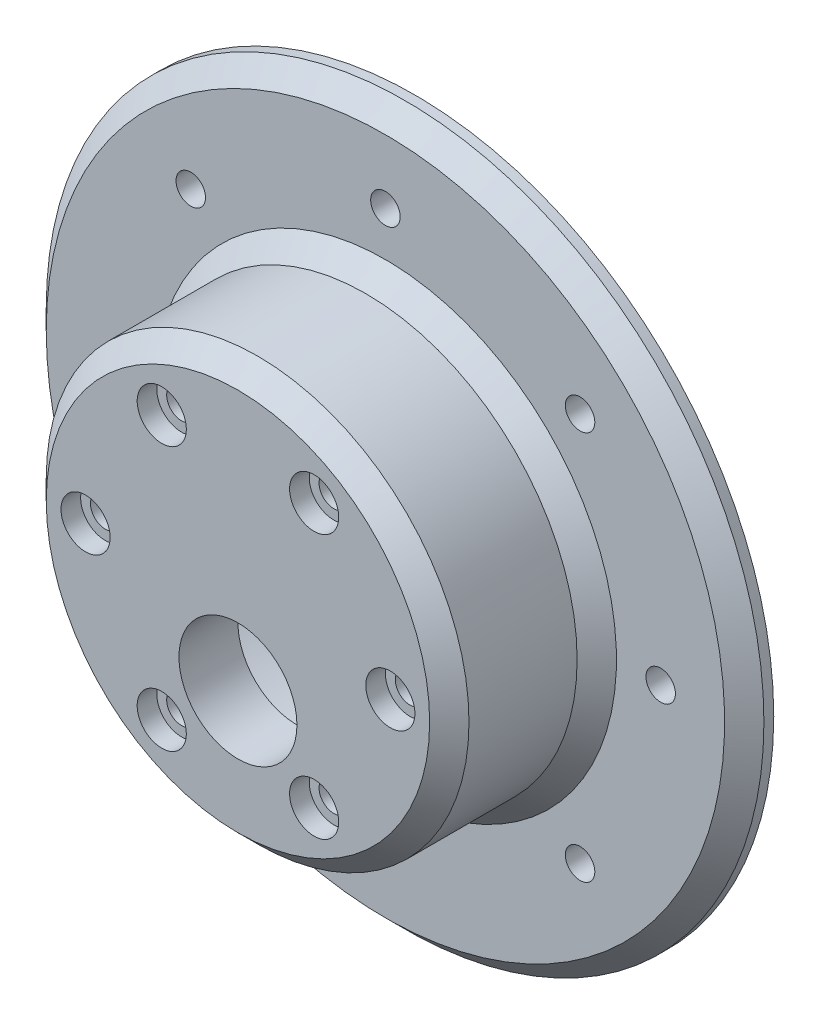
ISO-10303-21;
HEADER;
FILE_DESCRIPTION(('STEP AP214'),'2;1');
FILE_NAME('part.step','',(''),(''),'','','');
FILE_SCHEMA(('AUTOMOTIVE_DESIGN { 1 0 10303 214 1 1 1 1 }'));
ENDSEC;
DATA;
#1=APPLICATION_CONTEXT('core data for automotive mechanical design processes');
#2=APPLICATION_PROTOCOL_DEFINITION('international standard','automotive_design',2000,#1);
#3=PRODUCT_CONTEXT('',#1,'mechanical');
#4=PRODUCT('Part','Part','',(#3));
#5=PRODUCT_RELATED_PRODUCT_CATEGORY('part','',(#4));
#6=PRODUCT_DEFINITION_FORMATION('','',#4);
#7=PRODUCT_DEFINITION_CONTEXT('part definition',#1,'design');
#8=PRODUCT_DEFINITION('design','',#6,#7);
#9=PRODUCT_DEFINITION_SHAPE('','',#8);
#10=(LENGTH_UNIT() NAMED_UNIT(*) SI_UNIT(.MILLI.,.METRE.));
#11=(NAMED_UNIT(*) PLANE_ANGLE_UNIT() SI_UNIT($,.RADIAN.));
#12=(NAMED_UNIT(*) SI_UNIT($,.STERADIAN.) SOLID_ANGLE_UNIT());
#13=UNCERTAINTY_MEASURE_WITH_UNIT(LENGTH_MEASURE(1.E-05),#10,'distance_accuracy_value','');
#14=(GEOMETRIC_REPRESENTATION_CONTEXT(3) GLOBAL_UNCERTAINTY_ASSIGNED_CONTEXT((#13)) GLOBAL_UNIT_ASSIGNED_CONTEXT((#10,
#11,#12)) REPRESENTATION_CONTEXT('',''));
#15=CARTESIAN_POINT('',(0.,0.,0.));
#16=DIRECTION('',(0.,0.,1.));
#17=DIRECTION('',(1.,0.,0.));
#18=AXIS2_PLACEMENT_3D('',#15,#16,#17);
#19=CARTESIAN_POINT('',(0.,36.5,-9.));
#20=DIRECTION('',(0.,0.,-1.));
#21=DIRECTION('',(-1.,0.,0.));
#22=AXIS2_PLACEMENT_3D('',#19,#20,#21);
#23=PLANE('',#22);
#24=CARTESIAN_POINT('',(19.7989898732231,19.7989898732236,-9.));
#25=DIRECTION('',(0.,0.,1.));
#26=DIRECTION('',(1.,0.,0.));
#27=AXIS2_PLACEMENT_3D('',#24,#25,#26);
#28=CIRCLE('',#27,1.49999999999999);
#29=CARTESIAN_POINT('',(21.2989898732231,19.7989898732236,-9.));
#30=VERTEX_POINT('',#29);
#31=EDGE_CURVE('E63',#30,#30,#28,.T.);
#32=ORIENTED_EDGE('',*,*,#31,.F.);
#33=EDGE_LOOP('',(#32));
#34=FACE_BOUND('',#33,.T.);
#35=CARTESIAN_POINT('',(28.,2.93284432462823E-13,-9.));
#36=DIRECTION('',(0.,0.,1.));
#37=DIRECTION('',(1.,0.,0.));
#38=AXIS2_PLACEMENT_3D('',#35,#36,#37);
#39=CIRCLE('',#38,1.49999999999999);
#40=CARTESIAN_POINT('',(29.5,2.93284432462823E-13,-9.));
#41=VERTEX_POINT('',#40);
#42=EDGE_CURVE('E52',#41,#41,#39,.T.);
#43=ORIENTED_EDGE('',*,*,#42,.F.);
#44=EDGE_LOOP('',(#43));
#45=FACE_BOUND('',#44,.T.);
#46=CARTESIAN_POINT('',(0.,0.,-9.));
#47=DIRECTION('',(0.,0.,-1.));
#48=DIRECTION('',(-1.,0.,0.));
#49=AXIS2_PLACEMENT_3D('',#46,#47,#48);
#50=CIRCLE('',#49,34.5);
#51=CARTESIAN_POINT('',(-34.5,0.,-9.));
#52=VERTEX_POINT('',#51);
#53=EDGE_CURVE('E203',#52,#52,#50,.F.);
#54=ORIENTED_EDGE('',*,*,#53,.T.);
#55=EDGE_LOOP('',(#54));
#56=FACE_BOUND('',#55,.T.);
#57=CARTESIAN_POINT('',(0.,0.,-9.));
#58=DIRECTION('',(0.,0.,-1.));
#59=DIRECTION('',(-1.,0.,0.));
#60=AXIS2_PLACEMENT_3D('',#57,#58,#59);
#61=CIRCLE('',#60,23.5);
#62=CARTESIAN_POINT('',(-23.5,0.,-9.));
#63=VERTEX_POINT('',#62);
#64=EDGE_CURVE('E46',#63,#63,#61,.T.);
#65=ORIENTED_EDGE('',*,*,#64,.T.);
#66=EDGE_LOOP('',(#65));
#67=FACE_BOUND('',#66,.T.);
#68=CARTESIAN_POINT('',(0.,28.,-9.));
#69=DIRECTION('',(0.,0.,1.));
#70=DIRECTION('',(1.,0.,0.));
#71=AXIS2_PLACEMENT_3D('',#68,#69,#70);
#72=CIRCLE('',#71,1.49999999999999);
#73=CARTESIAN_POINT('',(1.49999999999999,28.,-9.));
#74=VERTEX_POINT('',#73);
#75=EDGE_CURVE('E92',#74,#74,#72,.T.);
#76=ORIENTED_EDGE('',*,*,#75,.F.);
#77=EDGE_LOOP('',(#76));
#78=FACE_BOUND('',#77,.T.);
#79=CARTESIAN_POINT('',(-19.7989898732234,19.7989898732233,-9.));
#80=DIRECTION('',(0.,0.,1.));
#81=DIRECTION('',(1.,0.,0.));
#82=AXIS2_PLACEMENT_3D('',#79,#80,#81);
#83=CIRCLE('',#82,1.49999999999999);
#84=CARTESIAN_POINT('',(-18.2989898732234,19.7989898732233,-9.));
#85=VERTEX_POINT('',#84);
#86=EDGE_CURVE('E86',#85,#85,#83,.T.);
#87=ORIENTED_EDGE('',*,*,#86,.F.);
#88=EDGE_LOOP('',(#87));
#89=FACE_BOUND('',#88,.T.);
#90=CARTESIAN_POINT('',(-28.,0.,-9.));
#91=DIRECTION('',(0.,0.,1.));
#92=DIRECTION('',(1.,0.,0.));
#93=AXIS2_PLACEMENT_3D('',#90,#91,#92);
#94=CIRCLE('',#93,1.49999999999999);
#95=CARTESIAN_POINT('',(-26.5,0.,-9.));
#96=VERTEX_POINT('',#95);
#97=EDGE_CURVE('E80',#96,#96,#94,.T.);
#98=ORIENTED_EDGE('',*,*,#97,.F.);
#99=EDGE_LOOP('',(#98));
#100=FACE_BOUND('',#99,.T.);
#101=CARTESIAN_POINT('',(-19.7989898732232,-19.7989898732234,-9.));
#102=DIRECTION('',(0.,0.,1.));
#103=DIRECTION('',(1.,0.,0.));
#104=AXIS2_PLACEMENT_3D('',#101,#102,#103);
#105=CIRCLE('',#104,1.49999999999999);
#106=CARTESIAN_POINT('',(-18.2989898732232,-19.7989898732234,-9.));
#107=VERTEX_POINT('',#106);
#108=EDGE_CURVE('E74',#107,#107,#105,.T.);
#109=ORIENTED_EDGE('',*,*,#108,.F.);
#110=EDGE_LOOP('',(#109));
#111=FACE_BOUND('',#110,.T.);
#112=CARTESIAN_POINT('',(0.,-28.,-9.));
#113=DIRECTION('',(0.,0.,1.));
#114=DIRECTION('',(1.,0.,0.));
#115=AXIS2_PLACEMENT_3D('',#112,#113,#114);
#116=CIRCLE('',#115,1.49999999999999);
#117=CARTESIAN_POINT('',(1.49999999999999,-28.,-9.));
#118=VERTEX_POINT('',#117);
#119=EDGE_CURVE('E68',#118,#118,#116,.T.);
#120=ORIENTED_EDGE('',*,*,#119,.F.);
#121=EDGE_LOOP('',(#120));
#122=FACE_BOUND('',#121,.T.);
#123=CARTESIAN_POINT('',(19.7989898732235,-19.7989898732232,-9.));
#124=DIRECTION('',(0.,0.,1.));
#125=DIRECTION('',(1.,0.,0.));
#126=AXIS2_PLACEMENT_3D('',#123,#124,#125);
#127=CIRCLE('',#126,1.49999999999999);
#128=CARTESIAN_POINT('',(21.2989898732235,-19.7989898732232,-9.));
#129=VERTEX_POINT('',#128);
#130=EDGE_CURVE('E51',#129,#129,#127,.T.);
#131=ORIENTED_EDGE('',*,*,#130,.F.);
#132=EDGE_LOOP('',(#131));
#133=FACE_BOUND('',#132,.T.);
#134=ADVANCED_FACE('F33',(#34,#45,#56,#67,#78,#89,#100,#111,#122,#133),#23,.F.);
#135=CARTESIAN_POINT('',(0.,0.,0.));
#136=DIRECTION('',(0.,0.,1.));
#137=DIRECTION('',(1.,0.,0.));
#138=AXIS2_PLACEMENT_3D('',#135,#136,#137);
#139=PLANE('',#138);
#140=CARTESIAN_POINT('',(0.,-7.,0.));
#141=DIRECTION('',(0.,0.,1.));
#142=DIRECTION('',(1.,0.,0.));
#143=AXIS2_PLACEMENT_3D('',#140,#141,#142);
#144=CIRCLE('',#143,6.);
#145=CARTESIAN_POINT('',(6.,-7.,0.));
#146=VERTEX_POINT('',#145);
#147=EDGE_CURVE('E101',#146,#146,#144,.T.);
#148=ORIENTED_EDGE('',*,*,#147,.T.);
#149=EDGE_LOOP('',(#148));
#150=FACE_BOUND('',#149,.T.);
#151=CARTESIAN_POINT('',(7.75000000000016,-13.4233937586587,0.));
#152=DIRECTION('',(0.,0.,1.));
#153=DIRECTION('',(1.,0.,0.));
#154=AXIS2_PLACEMENT_3D('',#151,#152,#153);
#155=CIRCLE('',#154,1.5);
#156=CARTESIAN_POINT('',(9.25000000000016,-13.4233937586587,0.));
#157=VERTEX_POINT('',#156);
#158=EDGE_CURVE('E113',#157,#157,#155,.T.);
#159=ORIENTED_EDGE('',*,*,#158,.T.);
#160=EDGE_LOOP('',(#159));
#161=FACE_BOUND('',#160,.T.);
#162=CARTESIAN_POINT('',(-7.74999999999987,-13.4233937586589,0.));
#163=DIRECTION('',(0.,0.,1.));
#164=DIRECTION('',(1.,0.,0.));
#165=AXIS2_PLACEMENT_3D('',#162,#163,#164);
#166=CIRCLE('',#165,1.5);
#167=CARTESIAN_POINT('',(-6.24999999999988,-13.4233937586589,0.));
#168=VERTEX_POINT('',#167);
#169=EDGE_CURVE('E123',#168,#168,#166,.T.);
#170=ORIENTED_EDGE('',*,*,#169,.T.);
#171=EDGE_LOOP('',(#170));
#172=FACE_BOUND('',#171,.T.);
#173=CARTESIAN_POINT('',(-15.5,0.,0.));
#174=DIRECTION('',(0.,0.,1.));
#175=DIRECTION('',(1.,0.,0.));
#176=AXIS2_PLACEMENT_3D('',#173,#174,#175);
#177=CIRCLE('',#176,1.5);
#178=CARTESIAN_POINT('',(-14.,0.,0.));
#179=VERTEX_POINT('',#178);
#180=EDGE_CURVE('E133',#179,#179,#177,.T.);
#181=ORIENTED_EDGE('',*,*,#180,.T.);
#182=EDGE_LOOP('',(#181));
#183=FACE_BOUND('',#182,.T.);
#184=CARTESIAN_POINT('',(-7.75000000000006,13.4233937586588,0.));
#185=DIRECTION('',(0.,0.,1.));
#186=DIRECTION('',(1.,0.,0.));
#187=AXIS2_PLACEMENT_3D('',#184,#185,#186);
#188=CIRCLE('',#187,1.5);
#189=CARTESIAN_POINT('',(-6.25000000000006,13.4233937586588,0.));
#190=VERTEX_POINT('',#189);
#191=EDGE_CURVE('E143',#190,#190,#188,.T.);
#192=ORIENTED_EDGE('',*,*,#191,.T.);
#193=EDGE_LOOP('',(#192));
#194=FACE_BOUND('',#193,.T.);
#195=CARTESIAN_POINT('',(7.74999999999997,13.4233937586588,0.));
#196=DIRECTION('',(0.,0.,1.));
#197=DIRECTION('',(1.,0.,0.));
#198=AXIS2_PLACEMENT_3D('',#195,#196,#197);
#199=CIRCLE('',#198,1.5);
#200=CARTESIAN_POINT('',(9.24999999999997,13.4233937586588,0.));
#201=VERTEX_POINT('',#200);
#202=EDGE_CURVE('E153',#201,#201,#199,.T.);
#203=ORIENTED_EDGE('',*,*,#202,.T.);
#204=EDGE_LOOP('',(#203));
#205=FACE_BOUND('',#204,.T.);
#206=CARTESIAN_POINT('',(15.5,0.,0.));
#207=DIRECTION('',(0.,0.,1.));
#208=DIRECTION('',(1.,0.,0.));
#209=AXIS2_PLACEMENT_3D('',#206,#207,#208);
#210=CIRCLE('',#209,1.5);
#211=CARTESIAN_POINT('',(17.,0.,0.));
#212=VERTEX_POINT('',#211);
#213=EDGE_CURVE('E163',#212,#212,#210,.T.);
#214=ORIENTED_EDGE('',*,*,#213,.T.);
#215=EDGE_LOOP('',(#214));
#216=FACE_BOUND('',#215,.T.);
#217=CARTESIAN_POINT('',(0.,0.,0.));
#218=DIRECTION('',(0.,0.,1.));
#219=DIRECTION('',(1.,0.,0.));
#220=AXIS2_PLACEMENT_3D('',#217,#218,#219);
#221=CIRCLE('',#220,18.5);
#222=CARTESIAN_POINT('',(18.5,0.,0.));
#223=VERTEX_POINT('',#222);
#224=EDGE_CURVE('E182',#223,#223,#221,.T.);
#225=ORIENTED_EDGE('',*,*,#224,.F.);
#226=EDGE_LOOP('',(#225));
#227=FACE_BOUND('',#226,.T.);
#228=ADVANCED_FACE('F238',(#150,#161,#172,#183,#194,#205,#216,#227),#139,.F.);
#229=CARTESIAN_POINT('',(0.,0.,6.));
#230=DIRECTION('',(0.,0.,1.));
#231=DIRECTION('',(1.,0.,0.));
#232=AXIS2_PLACEMENT_3D('',#229,#230,#231);
#233=CYLINDRICAL_SURFACE('',#232,18.5);
#234=CARTESIAN_POINT('',(0.,0.,-12.));
#235=DIRECTION('',(0.,0.,1.));
#236=DIRECTION('',(1.,0.,0.));
#237=AXIS2_PLACEMENT_3D('',#234,#235,#236);
#238=CIRCLE('',#237,18.5);
#239=CARTESIAN_POINT('',(18.5,0.,-12.));
#240=VERTEX_POINT('',#239);
#241=EDGE_CURVE('E179',#240,#240,#238,.T.);
#242=ORIENTED_EDGE('',*,*,#241,.F.);
#243=EDGE_LOOP('',(#242));
#244=FACE_BOUND('',#243,.T.);
#245=ORIENTED_EDGE('',*,*,#224,.T.);
#246=EDGE_LOOP('',(#245));
#247=FACE_BOUND('',#246,.T.);
#248=ADVANCED_FACE('F244',(#244,#247),#233,.F.);
#249=CARTESIAN_POINT('',(0.,18.5,-12.));
#250=DIRECTION('',(0.,0.,1.));
#251=DIRECTION('',(1.,0.,0.));
#252=AXIS2_PLACEMENT_3D('',#249,#250,#251);
#253=PLANE('',#252);
#254=CARTESIAN_POINT('',(0.,0.,-12.));
#255=DIRECTION('',(0.,0.,1.));
#256=DIRECTION('',(1.,0.,0.));
#257=AXIS2_PLACEMENT_3D('',#254,#255,#256);
#258=CIRCLE('',#257,23.5);
#259=CARTESIAN_POINT('',(23.5,0.,-12.));
#260=VERTEX_POINT('',#259);
#261=EDGE_CURVE('E176',#260,#260,#258,.T.);
#262=ORIENTED_EDGE('',*,*,#261,.F.);
#263=EDGE_LOOP('',(#262));
#264=FACE_BOUND('',#263,.T.);
#265=ORIENTED_EDGE('',*,*,#241,.T.);
#266=EDGE_LOOP('',(#265));
#267=FACE_BOUND('',#266,.T.);
#268=ADVANCED_FACE('F269',(#264,#267),#253,.F.);
#269=CARTESIAN_POINT('',(0.,0.,6.));
#270=DIRECTION('',(0.,0.,1.));
#271=DIRECTION('',(1.,0.,0.));
#272=AXIS2_PLACEMENT_3D('',#269,#270,#271);
#273=CYLINDRICAL_SURFACE('',#272,23.5);
#274=CARTESIAN_POINT('',(0.,0.,-11.));
#275=DIRECTION('',(0.,0.,1.));
#276=DIRECTION('',(1.,0.,0.));
#277=AXIS2_PLACEMENT_3D('',#274,#275,#276);
#278=CIRCLE('',#277,23.5);
#279=CARTESIAN_POINT('',(23.5,0.,-11.));
#280=VERTEX_POINT('',#279);
#281=EDGE_CURVE('E173',#280,#280,#278,.T.);
#282=ORIENTED_EDGE('',*,*,#281,.F.);
#283=EDGE_LOOP('',(#282));
#284=FACE_BOUND('',#283,.T.);
#285=ORIENTED_EDGE('',*,*,#261,.T.);
#286=EDGE_LOOP('',(#285));
#287=FACE_BOUND('',#286,.T.);
#288=ADVANCED_FACE('F265',(#284,#287),#273,.T.);
#289=CARTESIAN_POINT('',(0.,23.5,-11.));
#290=DIRECTION('',(0.,0.,1.));
#291=DIRECTION('',(1.,0.,0.));
#292=AXIS2_PLACEMENT_3D('',#289,#290,#291);
#293=PLANE('',#292);
#294=CARTESIAN_POINT('',(0.,0.,-11.));
#295=DIRECTION('',(0.,0.,1.));
#296=DIRECTION('',(1.,0.,0.));
#297=AXIS2_PLACEMENT_3D('',#294,#295,#296);
#298=CIRCLE('',#297,25.5);
#299=CARTESIAN_POINT('',(25.5,0.,-11.));
#300=VERTEX_POINT('',#299);
#301=EDGE_CURVE('E170',#300,#300,#298,.T.);
#302=ORIENTED_EDGE('',*,*,#301,.F.);
#303=EDGE_LOOP('',(#302));
#304=FACE_BOUND('',#303,.T.);
#305=ORIENTED_EDGE('',*,*,#281,.T.);
#306=EDGE_LOOP('',(#305));
#307=FACE_BOUND('',#306,.T.);
#308=ADVANCED_FACE('F261',(#304,#307),#293,.F.);
#309=CARTESIAN_POINT('',(0.,0.,6.));
#310=DIRECTION('',(0.,0.,1.));
#311=DIRECTION('',(1.,0.,0.));
#312=AXIS2_PLACEMENT_3D('',#309,#310,#311);
#313=CYLINDRICAL_SURFACE('',#312,25.5);
#314=CARTESIAN_POINT('',(0.,0.,-12.));
#315=DIRECTION('',(0.,0.,1.));
#316=DIRECTION('',(1.,0.,0.));
#317=AXIS2_PLACEMENT_3D('',#314,#315,#316);
#318=CIRCLE('',#317,25.5);
#319=CARTESIAN_POINT('',(25.5,0.,-12.));
#320=VERTEX_POINT('',#319);
#321=EDGE_CURVE('E167',#320,#320,#318,.T.);
#322=ORIENTED_EDGE('',*,*,#321,.F.);
#323=EDGE_LOOP('',(#322));
#324=FACE_BOUND('',#323,.T.);
#325=ORIENTED_EDGE('',*,*,#301,.T.);
#326=EDGE_LOOP('',(#325));
#327=FACE_BOUND('',#326,.T.);
#328=ADVANCED_FACE('F257',(#324,#327),#313,.F.);
#329=CARTESIAN_POINT('',(0.,25.5,-12.));
#330=DIRECTION('',(0.,0.,1.));
#331=DIRECTION('',(1.,0.,0.));
#332=AXIS2_PLACEMENT_3D('',#329,#330,#331);
#333=PLANE('',#332);
#334=CARTESIAN_POINT('',(19.7989898732231,19.7989898732236,-12.));
#335=DIRECTION('',(0.,0.,1.));
#336=DIRECTION('',(1.,0.,0.));
#337=AXIS2_PLACEMENT_3D('',#334,#335,#336);
#338=CIRCLE('',#337,1.49999999999999);
#339=CARTESIAN_POINT('',(21.2989898732231,19.7989898732236,-12.));
#340=VERTEX_POINT('',#339);
#341=EDGE_CURVE('E37',#340,#340,#338,.T.);
#342=ORIENTED_EDGE('',*,*,#341,.T.);
#343=EDGE_LOOP('',(#342));
#344=FACE_BOUND('',#343,.T.);
#345=CARTESIAN_POINT('',(28.,2.93284432462823E-13,-12.));
#346=DIRECTION('',(0.,0.,1.));
#347=DIRECTION('',(1.,0.,0.));
#348=AXIS2_PLACEMENT_3D('',#345,#346,#347);
#349=CIRCLE('',#348,1.49999999999999);
#350=CARTESIAN_POINT('',(29.5,2.93284432462823E-13,-12.));
#351=VERTEX_POINT('',#350);
#352=EDGE_CURVE('E49',#351,#351,#349,.T.);
#353=ORIENTED_EDGE('',*,*,#352,.T.);
#354=EDGE_LOOP('',(#353));
#355=FACE_BOUND('',#354,.T.);
#356=CARTESIAN_POINT('',(19.7989898732235,-19.7989898732232,-12.));
#357=DIRECTION('',(0.,0.,1.));
#358=DIRECTION('',(1.,0.,0.));
#359=AXIS2_PLACEMENT_3D('',#356,#357,#358);
#360=CIRCLE('',#359,1.49999999999999);
#361=CARTESIAN_POINT('',(21.2989898732235,-19.7989898732232,-12.));
#362=VERTEX_POINT('',#361);
#363=EDGE_CURVE('E56',#362,#362,#360,.T.);
#364=ORIENTED_EDGE('',*,*,#363,.T.);
#365=EDGE_LOOP('',(#364));
#366=FACE_BOUND('',#365,.T.);
#367=CARTESIAN_POINT('',(0.,-28.,-12.));
#368=DIRECTION('',(0.,0.,1.));
#369=DIRECTION('',(1.,0.,0.));
#370=AXIS2_PLACEMENT_3D('',#367,#368,#369);
#371=CIRCLE('',#370,1.49999999999999);
#372=CARTESIAN_POINT('',(1.49999999999999,-28.,-12.));
#373=VERTEX_POINT('',#372);
#374=EDGE_CURVE('E71',#373,#373,#371,.T.);
#375=ORIENTED_EDGE('',*,*,#374,.T.);
#376=EDGE_LOOP('',(#375));
#377=FACE_BOUND('',#376,.T.);
#378=CARTESIAN_POINT('',(-19.7989898732232,-19.7989898732234,-12.));
#379=DIRECTION('',(0.,0.,1.));
#380=DIRECTION('',(1.,0.,0.));
#381=AXIS2_PLACEMENT_3D('',#378,#379,#380);
#382=CIRCLE('',#381,1.49999999999999);
#383=CARTESIAN_POINT('',(-18.2989898732232,-19.7989898732234,-12.));
#384=VERTEX_POINT('',#383);
#385=EDGE_CURVE('E77',#384,#384,#382,.T.);
#386=ORIENTED_EDGE('',*,*,#385,.T.);
#387=EDGE_LOOP('',(#386));
#388=FACE_BOUND('',#387,.T.);
#389=CARTESIAN_POINT('',(-28.,0.,-12.));
#390=DIRECTION('',(0.,0.,1.));
#391=DIRECTION('',(1.,0.,0.));
#392=AXIS2_PLACEMENT_3D('',#389,#390,#391);
#393=CIRCLE('',#392,1.49999999999999);
#394=CARTESIAN_POINT('',(-26.5,0.,-12.));
#395=VERTEX_POINT('',#394);
#396=EDGE_CURVE('E83',#395,#395,#393,.T.);
#397=ORIENTED_EDGE('',*,*,#396,.T.);
#398=EDGE_LOOP('',(#397));
#399=FACE_BOUND('',#398,.T.);
#400=CARTESIAN_POINT('',(-19.7989898732234,19.7989898732233,-12.));
#401=DIRECTION('',(0.,0.,1.));
#402=DIRECTION('',(1.,0.,0.));
#403=AXIS2_PLACEMENT_3D('',#400,#401,#402);
#404=CIRCLE('',#403,1.49999999999999);
#405=CARTESIAN_POINT('',(-18.2989898732234,19.7989898732233,-12.));
#406=VERTEX_POINT('',#405);
#407=EDGE_CURVE('E89',#406,#406,#404,.T.);
#408=ORIENTED_EDGE('',*,*,#407,.T.);
#409=EDGE_LOOP('',(#408));
#410=FACE_BOUND('',#409,.T.);
#411=CARTESIAN_POINT('',(0.,28.,-12.));
#412=DIRECTION('',(0.,0.,1.));
#413=DIRECTION('',(1.,0.,0.));
#414=AXIS2_PLACEMENT_3D('',#411,#412,#413);
#415=CIRCLE('',#414,1.49999999999999);
#416=CARTESIAN_POINT('',(1.49999999999999,28.,-12.));
#417=VERTEX_POINT('',#416);
#418=EDGE_CURVE('E95',#417,#417,#415,.T.);
#419=ORIENTED_EDGE('',*,*,#418,.T.);
#420=EDGE_LOOP('',(#419));
#421=FACE_BOUND('',#420,.T.);
#422=CARTESIAN_POINT('',(0.,0.,-12.));
#423=DIRECTION('',(0.,0.,1.));
#424=DIRECTION('',(1.,0.,0.));
#425=AXIS2_PLACEMENT_3D('',#422,#423,#424);
#426=CIRCLE('',#425,36.5);
#427=CARTESIAN_POINT('',(36.5,0.,-12.));
#428=VERTEX_POINT('',#427);
#429=EDGE_CURVE('E164',#428,#428,#426,.T.);
#430=ORIENTED_EDGE('',*,*,#429,.F.);
#431=EDGE_LOOP('',(#430));
#432=FACE_BOUND('',#431,.T.);
#433=ORIENTED_EDGE('',*,*,#321,.T.);
#434=EDGE_LOOP('',(#433));
#435=FACE_BOUND('',#434,.T.);
#436=ADVANCED_FACE('F253',(#344,#355,#366,#377,#388,#399,#410,#421,#432,#435),#333,.F.);
#437=CARTESIAN_POINT('',(0.,0.,6.));
#438=DIRECTION('',(0.,0.,1.));
#439=DIRECTION('',(1.,0.,0.));
#440=AXIS2_PLACEMENT_3D('',#437,#438,#439);
#441=CYLINDRICAL_SURFACE('',#440,36.5);
#442=CARTESIAN_POINT('',(0.,0.,-11.));
#443=DIRECTION('',(0.,0.,-1.));
#444=DIRECTION('',(-1.,0.,0.));
#445=AXIS2_PLACEMENT_3D('',#442,#443,#444);
#446=CIRCLE('',#445,36.5);
#447=CARTESIAN_POINT('',(-36.5,0.,-11.));
#448=VERTEX_POINT('',#447);
#449=EDGE_CURVE('E41',#448,#448,#446,.T.);
#450=ORIENTED_EDGE('',*,*,#449,.T.);
#451=EDGE_LOOP('',(#450));
#452=FACE_BOUND('',#451,.T.);
#453=ORIENTED_EDGE('',*,*,#429,.T.);
#454=EDGE_LOOP('',(#453));
#455=FACE_BOUND('',#454,.T.);
#456=ADVANCED_FACE('F222',(#452,#455),#441,.T.);
#457=CARTESIAN_POINT('',(0.,0.,6.));
#458=DIRECTION('',(0.,0.,1.));
#459=DIRECTION('',(1.,0.,0.));
#460=AXIS2_PLACEMENT_3D('',#457,#458,#459);
#461=CYLINDRICAL_SURFACE('',#460,21.5);
#462=CARTESIAN_POINT('',(0.,0.,-6.99999999999999));
#463=DIRECTION('',(0.,0.,-1.));
#464=DIRECTION('',(-1.,0.,0.));
#465=AXIS2_PLACEMENT_3D('',#462,#463,#464);
#466=CIRCLE('',#465,21.5);
#467=CARTESIAN_POINT('',(-21.5,0.,-6.99999999999999));
#468=VERTEX_POINT('',#467);
#469=EDGE_CURVE('E200',#468,#468,#466,.F.);
#470=ORIENTED_EDGE('',*,*,#469,.T.);
#471=EDGE_LOOP('',(#470));
#472=FACE_BOUND('',#471,.T.);
#473=CARTESIAN_POINT('',(0.,0.,4.));
#474=DIRECTION('',(0.,0.,-1.));
#475=DIRECTION('',(-1.,0.,0.));
#476=AXIS2_PLACEMENT_3D('',#473,#474,#475);
#477=CIRCLE('',#476,21.5);
#478=CARTESIAN_POINT('',(-21.5,0.,4.));
#479=VERTEX_POINT('',#478);
#480=EDGE_CURVE('E185',#479,#479,#477,.T.);
#481=ORIENTED_EDGE('',*,*,#480,.T.);
#482=EDGE_LOOP('',(#481));
#483=FACE_BOUND('',#482,.T.);
#484=ADVANCED_FACE('F218',(#472,#483),#461,.T.);
#485=CARTESIAN_POINT('',(0.,21.5,6.));
#486=DIRECTION('',(0.,0.,-1.));
#487=DIRECTION('',(-1.,0.,0.));
#488=AXIS2_PLACEMENT_3D('',#485,#486,#487);
#489=PLANE('',#488);
#490=CARTESIAN_POINT('',(0.,0.,6.));
#491=DIRECTION('',(0.,0.,-1.));
#492=DIRECTION('',(-1.,0.,0.));
#493=AXIS2_PLACEMENT_3D('',#490,#491,#492);
#494=CIRCLE('',#493,19.5);
#495=CARTESIAN_POINT('',(-19.5,0.,6.));
#496=VERTEX_POINT('',#495);
#497=EDGE_CURVE('E10',#496,#496,#494,.F.);
#498=ORIENTED_EDGE('',*,*,#497,.T.);
#499=EDGE_LOOP('',(#498));
#500=FACE_BOUND('',#499,.T.);
#501=CARTESIAN_POINT('',(0.,-7.,6.));
#502=DIRECTION('',(0.,0.,1.));
#503=DIRECTION('',(1.,0.,0.));
#504=AXIS2_PLACEMENT_3D('',#501,#502,#503);
#505=CIRCLE('',#504,6.);
#506=CARTESIAN_POINT('',(6.,-7.,6.));
#507=VERTEX_POINT('',#506);
#508=EDGE_CURVE('E98',#507,#507,#505,.T.);
#509=ORIENTED_EDGE('',*,*,#508,.F.);
#510=EDGE_LOOP('',(#509));
#511=FACE_BOUND('',#510,.T.);
#512=CARTESIAN_POINT('',(7.75000000000016,-13.4233937586587,6.));
#513=DIRECTION('',(0.,0.,1.));
#514=DIRECTION('',(1.,0.,0.));
#515=AXIS2_PLACEMENT_3D('',#512,#513,#514);
#516=CIRCLE('',#515,2.5);
#517=CARTESIAN_POINT('',(10.2500000000002,-13.4233937586587,6.));
#518=VERTEX_POINT('',#517);
#519=EDGE_CURVE('E104',#518,#518,#516,.T.);
#520=ORIENTED_EDGE('',*,*,#519,.F.);
#521=EDGE_LOOP('',(#520));
#522=FACE_BOUND('',#521,.T.);
#523=CARTESIAN_POINT('',(-7.74999999999987,-13.4233937586589,6.));
#524=DIRECTION('',(0.,0.,1.));
#525=DIRECTION('',(1.,0.,0.));
#526=AXIS2_PLACEMENT_3D('',#523,#524,#525);
#527=CIRCLE('',#526,2.5);
#528=CARTESIAN_POINT('',(-5.24999999999987,-13.4233937586589,6.));
#529=VERTEX_POINT('',#528);
#530=EDGE_CURVE('E114',#529,#529,#527,.T.);
#531=ORIENTED_EDGE('',*,*,#530,.F.);
#532=EDGE_LOOP('',(#531));
#533=FACE_BOUND('',#532,.T.);
#534=CARTESIAN_POINT('',(-15.5,0.,6.));
#535=DIRECTION('',(0.,0.,1.));
#536=DIRECTION('',(1.,0.,0.));
#537=AXIS2_PLACEMENT_3D('',#534,#535,#536);
#538=CIRCLE('',#537,2.5);
#539=CARTESIAN_POINT('',(-13.,0.,6.));
#540=VERTEX_POINT('',#539);
#541=EDGE_CURVE('E124',#540,#540,#538,.T.);
#542=ORIENTED_EDGE('',*,*,#541,.F.);
#543=EDGE_LOOP('',(#542));
#544=FACE_BOUND('',#543,.T.);
#545=CARTESIAN_POINT('',(-7.75000000000006,13.4233937586588,6.));
#546=DIRECTION('',(0.,0.,1.));
#547=DIRECTION('',(1.,0.,0.));
#548=AXIS2_PLACEMENT_3D('',#545,#546,#547);
#549=CIRCLE('',#548,2.5);
#550=CARTESIAN_POINT('',(-5.25000000000006,13.4233937586588,6.));
#551=VERTEX_POINT('',#550);
#552=EDGE_CURVE('E134',#551,#551,#549,.T.);
#553=ORIENTED_EDGE('',*,*,#552,.F.);
#554=EDGE_LOOP('',(#553));
#555=FACE_BOUND('',#554,.T.);
#556=CARTESIAN_POINT('',(7.74999999999997,13.4233937586588,6.));
#557=DIRECTION('',(0.,0.,1.));
#558=DIRECTION('',(1.,0.,0.));
#559=AXIS2_PLACEMENT_3D('',#556,#557,#558);
#560=CIRCLE('',#559,2.5);
#561=CARTESIAN_POINT('',(10.25,13.4233937586588,6.));
#562=VERTEX_POINT('',#561);
#563=EDGE_CURVE('E144',#562,#562,#560,.T.);
#564=ORIENTED_EDGE('',*,*,#563,.F.);
#565=EDGE_LOOP('',(#564));
#566=FACE_BOUND('',#565,.T.);
#567=CARTESIAN_POINT('',(15.5,0.,6.));
#568=DIRECTION('',(0.,0.,1.));
#569=DIRECTION('',(1.,0.,0.));
#570=AXIS2_PLACEMENT_3D('',#567,#568,#569);
#571=CIRCLE('',#570,2.5);
#572=CARTESIAN_POINT('',(18.,0.,6.));
#573=VERTEX_POINT('',#572);
#574=EDGE_CURVE('E154',#573,#573,#571,.T.);
#575=ORIENTED_EDGE('',*,*,#574,.F.);
#576=EDGE_LOOP('',(#575));
#577=FACE_BOUND('',#576,.T.);
#578=ADVANCED_FACE('F221',(#500,#511,#522,#533,#544,#555,#566,#577),#489,.F.);
#579=CARTESIAN_POINT('',(15.5,0.,6.));
#580=DIRECTION('',(0.,0.,1.));
#581=DIRECTION('',(1.,0.,0.));
#582=AXIS2_PLACEMENT_3D('',#579,#580,#581);
#583=CYLINDRICAL_SURFACE('',#582,1.5);
#584=CARTESIAN_POINT('',(15.5,0.,4.));
#585=DIRECTION('',(0.,0.,1.));
#586=DIRECTION('',(1.,0.,0.));
#587=AXIS2_PLACEMENT_3D('',#584,#585,#586);
#588=CIRCLE('',#587,1.5);
#589=CARTESIAN_POINT('',(17.,0.,4.));
#590=VERTEX_POINT('',#589);
#591=EDGE_CURVE('E160',#590,#590,#588,.T.);
#592=ORIENTED_EDGE('',*,*,#591,.T.);
#593=EDGE_LOOP('',(#592));
#594=FACE_BOUND('',#593,.T.);
#595=ORIENTED_EDGE('',*,*,#213,.F.);
#596=EDGE_LOOP('',(#595));
#597=FACE_BOUND('',#596,.T.);
#598=ADVANCED_FACE('F322',(#594,#597),#583,.F.);
#599=CARTESIAN_POINT('',(17.,0.,4.));
#600=DIRECTION('',(0.,0.,-1.));
#601=DIRECTION('',(-1.,0.,0.));
#602=AXIS2_PLACEMENT_3D('',#599,#600,#601);
#603=PLANE('',#602);
#604=ORIENTED_EDGE('',*,*,#591,.F.);
#605=EDGE_LOOP('',(#604));
#606=FACE_BOUND('',#605,.T.);
#607=CARTESIAN_POINT('',(15.5,0.,4.));
#608=DIRECTION('',(0.,0.,1.));
#609=DIRECTION('',(1.,0.,0.));
#610=AXIS2_PLACEMENT_3D('',#607,#608,#609);
#611=CIRCLE('',#610,2.5);
#612=CARTESIAN_POINT('',(18.,0.,4.));
#613=VERTEX_POINT('',#612);
#614=EDGE_CURVE('E157',#613,#613,#611,.T.);
#615=ORIENTED_EDGE('',*,*,#614,.T.);
#616=EDGE_LOOP('',(#615));
#617=FACE_BOUND('',#616,.T.);
#618=ADVANCED_FACE('F328',(#606,#617),#603,.F.);
#619=CARTESIAN_POINT('',(15.5,0.,6.));
#620=DIRECTION('',(0.,0.,1.));
#621=DIRECTION('',(1.,0.,0.));
#622=AXIS2_PLACEMENT_3D('',#619,#620,#621);
#623=CYLINDRICAL_SURFACE('',#622,2.5);
#624=ORIENTED_EDGE('',*,*,#614,.F.);
#625=EDGE_LOOP('',(#624));
#626=FACE_BOUND('',#625,.T.);
#627=ORIENTED_EDGE('',*,*,#574,.T.);
#628=EDGE_LOOP('',(#627));
#629=FACE_BOUND('',#628,.T.);
#630=ADVANCED_FACE('F336',(#626,#629),#623,.F.);
#631=CARTESIAN_POINT('',(7.74999999999997,13.4233937586588,6.));
#632=DIRECTION('',(0.,0.,1.));
#633=DIRECTION('',(1.,0.,0.));
#634=AXIS2_PLACEMENT_3D('',#631,#632,#633);
#635=CYLINDRICAL_SURFACE('',#634,1.5);
#636=CARTESIAN_POINT('',(7.74999999999997,13.4233937586588,4.));
#637=DIRECTION('',(0.,0.,1.));
#638=DIRECTION('',(1.,0.,0.));
#639=AXIS2_PLACEMENT_3D('',#636,#637,#638);
#640=CIRCLE('',#639,1.5);
#641=CARTESIAN_POINT('',(9.24999999999997,13.4233937586588,4.));
#642=VERTEX_POINT('',#641);
#643=EDGE_CURVE('E150',#642,#642,#640,.T.);
#644=ORIENTED_EDGE('',*,*,#643,.T.);
#645=EDGE_LOOP('',(#644));
#646=FACE_BOUND('',#645,.T.);
#647=ORIENTED_EDGE('',*,*,#202,.F.);
#648=EDGE_LOOP('',(#647));
#649=FACE_BOUND('',#648,.T.);
#650=ADVANCED_FACE('F344',(#646,#649),#635,.F.);
#651=CARTESIAN_POINT('',(9.24999999999997,13.4233937586588,4.));
#652=DIRECTION('',(0.,0.,-1.));
#653=DIRECTION('',(-1.,0.,0.));
#654=AXIS2_PLACEMENT_3D('',#651,#652,#653);
#655=PLANE('',#654);
#656=ORIENTED_EDGE('',*,*,#643,.F.);
#657=EDGE_LOOP('',(#656));
#658=FACE_BOUND('',#657,.T.);
#659=CARTESIAN_POINT('',(7.74999999999997,13.4233937586588,4.));
#660=DIRECTION('',(0.,0.,1.));
#661=DIRECTION('',(1.,0.,0.));
#662=AXIS2_PLACEMENT_3D('',#659,#660,#661);
#663=CIRCLE('',#662,2.5);
#664=CARTESIAN_POINT('',(10.25,13.4233937586588,4.));
#665=VERTEX_POINT('',#664);
#666=EDGE_CURVE('E147',#665,#665,#663,.T.);
#667=ORIENTED_EDGE('',*,*,#666,.T.);
#668=EDGE_LOOP('',(#667));
#669=FACE_BOUND('',#668,.T.);
#670=ADVANCED_FACE('F352',(#658,#669),#655,.F.);
#671=CARTESIAN_POINT('',(7.74999999999997,13.4233937586588,6.));
#672=DIRECTION('',(0.,0.,1.));
#673=DIRECTION('',(1.,0.,0.));
#674=AXIS2_PLACEMENT_3D('',#671,#672,#673);
#675=CYLINDRICAL_SURFACE('',#674,2.5);
#676=ORIENTED_EDGE('',*,*,#666,.F.);
#677=EDGE_LOOP('',(#676));
#678=FACE_BOUND('',#677,.T.);
#679=ORIENTED_EDGE('',*,*,#563,.T.);
#680=EDGE_LOOP('',(#679));
#681=FACE_BOUND('',#680,.T.);
#682=ADVANCED_FACE('F360',(#678,#681),#675,.F.);
#683=CARTESIAN_POINT('',(-7.75000000000006,13.4233937586588,6.));
#684=DIRECTION('',(0.,0.,1.));
#685=DIRECTION('',(1.,0.,0.));
#686=AXIS2_PLACEMENT_3D('',#683,#684,#685);
#687=CYLINDRICAL_SURFACE('',#686,1.5);
#688=CARTESIAN_POINT('',(-7.75000000000006,13.4233937586588,4.));
#689=DIRECTION('',(0.,0.,1.));
#690=DIRECTION('',(1.,0.,0.));
#691=AXIS2_PLACEMENT_3D('',#688,#689,#690);
#692=CIRCLE('',#691,1.5);
#693=CARTESIAN_POINT('',(-6.25000000000006,13.4233937586588,4.));
#694=VERTEX_POINT('',#693);
#695=EDGE_CURVE('E140',#694,#694,#692,.T.);
#696=ORIENTED_EDGE('',*,*,#695,.T.);
#697=EDGE_LOOP('',(#696));
#698=FACE_BOUND('',#697,.T.);
#699=ORIENTED_EDGE('',*,*,#191,.F.);
#700=EDGE_LOOP('',(#699));
#701=FACE_BOUND('',#700,.T.);
#702=ADVANCED_FACE('F368',(#698,#701),#687,.F.);
#703=CARTESIAN_POINT('',(-6.25000000000006,13.4233937586588,4.));
#704=DIRECTION('',(0.,0.,-1.));
#705=DIRECTION('',(-1.,0.,0.));
#706=AXIS2_PLACEMENT_3D('',#703,#704,#705);
#707=PLANE('',#706);
#708=ORIENTED_EDGE('',*,*,#695,.F.);
#709=EDGE_LOOP('',(#708));
#710=FACE_BOUND('',#709,.T.);
#711=CARTESIAN_POINT('',(-7.75000000000006,13.4233937586588,4.));
#712=DIRECTION('',(0.,0.,1.));
#713=DIRECTION('',(1.,0.,0.));
#714=AXIS2_PLACEMENT_3D('',#711,#712,#713);
#715=CIRCLE('',#714,2.5);
#716=CARTESIAN_POINT('',(-5.25000000000006,13.4233937586588,4.));
#717=VERTEX_POINT('',#716);
#718=EDGE_CURVE('E137',#717,#717,#715,.T.);
#719=ORIENTED_EDGE('',*,*,#718,.T.);
#720=EDGE_LOOP('',(#719));
#721=FACE_BOUND('',#720,.T.);
#722=ADVANCED_FACE('F376',(#710,#721),#707,.F.);
#723=CARTESIAN_POINT('',(-7.75000000000006,13.4233937586588,6.));
#724=DIRECTION('',(0.,0.,1.));
#725=DIRECTION('',(1.,0.,0.));
#726=AXIS2_PLACEMENT_3D('',#723,#724,#725);
#727=CYLINDRICAL_SURFACE('',#726,2.5);
#728=ORIENTED_EDGE('',*,*,#718,.F.);
#729=EDGE_LOOP('',(#728));
#730=FACE_BOUND('',#729,.T.);
#731=ORIENTED_EDGE('',*,*,#552,.T.);
#732=EDGE_LOOP('',(#731));
#733=FACE_BOUND('',#732,.T.);
#734=ADVANCED_FACE('F384',(#730,#733),#727,.F.);
#735=CARTESIAN_POINT('',(-15.5,0.,6.));
#736=DIRECTION('',(0.,0.,1.));
#737=DIRECTION('',(1.,0.,0.));
#738=AXIS2_PLACEMENT_3D('',#735,#736,#737);
#739=CYLINDRICAL_SURFACE('',#738,1.5);
#740=CARTESIAN_POINT('',(-15.5,0.,4.));
#741=DIRECTION('',(0.,0.,1.));
#742=DIRECTION('',(1.,0.,0.));
#743=AXIS2_PLACEMENT_3D('',#740,#741,#742);
#744=CIRCLE('',#743,1.5);
#745=CARTESIAN_POINT('',(-14.,0.,4.));
#746=VERTEX_POINT('',#745);
#747=EDGE_CURVE('E130',#746,#746,#744,.T.);
#748=ORIENTED_EDGE('',*,*,#747,.T.);
#749=EDGE_LOOP('',(#748));
#750=FACE_BOUND('',#749,.T.);
#751=ORIENTED_EDGE('',*,*,#180,.F.);
#752=EDGE_LOOP('',(#751));
#753=FACE_BOUND('',#752,.T.);
#754=ADVANCED_FACE('F392',(#750,#753),#739,.F.);
#755=CARTESIAN_POINT('',(-14.,0.,4.));
#756=DIRECTION('',(0.,0.,-1.));
#757=DIRECTION('',(-1.,0.,0.));
#758=AXIS2_PLACEMENT_3D('',#755,#756,#757);
#759=PLANE('',#758);
#760=ORIENTED_EDGE('',*,*,#747,.F.);
#761=EDGE_LOOP('',(#760));
#762=FACE_BOUND('',#761,.T.);
#763=CARTESIAN_POINT('',(-15.5,0.,4.));
#764=DIRECTION('',(0.,0.,1.));
#765=DIRECTION('',(1.,0.,0.));
#766=AXIS2_PLACEMENT_3D('',#763,#764,#765);
#767=CIRCLE('',#766,2.5);
#768=CARTESIAN_POINT('',(-13.,0.,4.));
#769=VERTEX_POINT('',#768);
#770=EDGE_CURVE('E127',#769,#769,#767,.T.);
#771=ORIENTED_EDGE('',*,*,#770,.T.);
#772=EDGE_LOOP('',(#771));
#773=FACE_BOUND('',#772,.T.);
#774=ADVANCED_FACE('F400',(#762,#773),#759,.F.);
#775=CARTESIAN_POINT('',(-15.5,0.,6.));
#776=DIRECTION('',(0.,0.,1.));
#777=DIRECTION('',(1.,0.,0.));
#778=AXIS2_PLACEMENT_3D('',#775,#776,#777);
#779=CYLINDRICAL_SURFACE('',#778,2.5);
#780=ORIENTED_EDGE('',*,*,#770,.F.);
#781=EDGE_LOOP('',(#780));
#782=FACE_BOUND('',#781,.T.);
#783=ORIENTED_EDGE('',*,*,#541,.T.);
#784=EDGE_LOOP('',(#783));
#785=FACE_BOUND('',#784,.T.);
#786=ADVANCED_FACE('F408',(#782,#785),#779,.F.);
#787=CARTESIAN_POINT('',(-7.74999999999987,-13.4233937586589,6.));
#788=DIRECTION('',(0.,0.,1.));
#789=DIRECTION('',(1.,0.,0.));
#790=AXIS2_PLACEMENT_3D('',#787,#788,#789);
#791=CYLINDRICAL_SURFACE('',#790,1.5);
#792=CARTESIAN_POINT('',(-7.74999999999987,-13.4233937586589,4.));
#793=DIRECTION('',(0.,0.,1.));
#794=DIRECTION('',(1.,0.,0.));
#795=AXIS2_PLACEMENT_3D('',#792,#793,#794);
#796=CIRCLE('',#795,1.5);
#797=CARTESIAN_POINT('',(-6.24999999999987,-13.4233937586589,4.));
#798=VERTEX_POINT('',#797);
#799=EDGE_CURVE('E120',#798,#798,#796,.T.);
#800=ORIENTED_EDGE('',*,*,#799,.T.);
#801=EDGE_LOOP('',(#800));
#802=FACE_BOUND('',#801,.T.);
#803=ORIENTED_EDGE('',*,*,#169,.F.);
#804=EDGE_LOOP('',(#803));
#805=FACE_BOUND('',#804,.T.);
#806=ADVANCED_FACE('F416',(#802,#805),#791,.F.);
#807=CARTESIAN_POINT('',(-6.24999999999987,-13.4233937586589,4.));
#808=DIRECTION('',(0.,0.,-1.));
#809=DIRECTION('',(-1.,0.,0.));
#810=AXIS2_PLACEMENT_3D('',#807,#808,#809);
#811=PLANE('',#810);
#812=ORIENTED_EDGE('',*,*,#799,.F.);
#813=EDGE_LOOP('',(#812));
#814=FACE_BOUND('',#813,.T.);
#815=CARTESIAN_POINT('',(-7.74999999999987,-13.4233937586589,4.));
#816=DIRECTION('',(0.,0.,1.));
#817=DIRECTION('',(1.,0.,0.));
#818=AXIS2_PLACEMENT_3D('',#815,#816,#817);
#819=CIRCLE('',#818,2.5);
#820=CARTESIAN_POINT('',(-5.24999999999988,-13.4233937586589,4.));
#821=VERTEX_POINT('',#820);
#822=EDGE_CURVE('E117',#821,#821,#819,.T.);
#823=ORIENTED_EDGE('',*,*,#822,.T.);
#824=EDGE_LOOP('',(#823));
#825=FACE_BOUND('',#824,.T.);
#826=ADVANCED_FACE('F424',(#814,#825),#811,.F.);
#827=CARTESIAN_POINT('',(-7.74999999999987,-13.4233937586589,6.));
#828=DIRECTION('',(0.,0.,1.));
#829=DIRECTION('',(1.,0.,0.));
#830=AXIS2_PLACEMENT_3D('',#827,#828,#829);
#831=CYLINDRICAL_SURFACE('',#830,2.5);
#832=ORIENTED_EDGE('',*,*,#822,.F.);
#833=EDGE_LOOP('',(#832));
#834=FACE_BOUND('',#833,.T.);
#835=ORIENTED_EDGE('',*,*,#530,.T.);
#836=EDGE_LOOP('',(#835));
#837=FACE_BOUND('',#836,.T.);
#838=ADVANCED_FACE('F432',(#834,#837),#831,.F.);
#839=CARTESIAN_POINT('',(7.75000000000016,-13.4233937586587,6.));
#840=DIRECTION('',(0.,0.,1.));
#841=DIRECTION('',(1.,0.,0.));
#842=AXIS2_PLACEMENT_3D('',#839,#840,#841);
#843=CYLINDRICAL_SURFACE('',#842,1.5);
#844=CARTESIAN_POINT('',(7.75000000000016,-13.4233937586587,4.));
#845=DIRECTION('',(0.,0.,1.));
#846=DIRECTION('',(1.,0.,0.));
#847=AXIS2_PLACEMENT_3D('',#844,#845,#846);
#848=CIRCLE('',#847,1.5);
#849=CARTESIAN_POINT('',(9.25000000000016,-13.4233937586587,4.));
#850=VERTEX_POINT('',#849);
#851=EDGE_CURVE('E110',#850,#850,#848,.T.);
#852=ORIENTED_EDGE('',*,*,#851,.T.);
#853=EDGE_LOOP('',(#852));
#854=FACE_BOUND('',#853,.T.);
#855=ORIENTED_EDGE('',*,*,#158,.F.);
#856=EDGE_LOOP('',(#855));
#857=FACE_BOUND('',#856,.T.);
#858=ADVANCED_FACE('F440',(#854,#857),#843,.F.);
#859=CARTESIAN_POINT('',(9.25000000000016,-13.4233937586587,4.));
#860=DIRECTION('',(0.,0.,-1.));
#861=DIRECTION('',(-1.,0.,0.));
#862=AXIS2_PLACEMENT_3D('',#859,#860,#861);
#863=PLANE('',#862);
#864=ORIENTED_EDGE('',*,*,#851,.F.);
#865=EDGE_LOOP('',(#864));
#866=FACE_BOUND('',#865,.T.);
#867=CARTESIAN_POINT('',(7.75000000000016,-13.4233937586587,4.));
#868=DIRECTION('',(0.,0.,1.));
#869=DIRECTION('',(1.,0.,0.));
#870=AXIS2_PLACEMENT_3D('',#867,#868,#869);
#871=CIRCLE('',#870,2.5);
#872=CARTESIAN_POINT('',(10.2500000000002,-13.4233937586587,4.));
#873=VERTEX_POINT('',#872);
#874=EDGE_CURVE('E107',#873,#873,#871,.T.);
#875=ORIENTED_EDGE('',*,*,#874,.T.);
#876=EDGE_LOOP('',(#875));
#877=FACE_BOUND('',#876,.T.);
#878=ADVANCED_FACE('F448',(#866,#877),#863,.F.);
#879=CARTESIAN_POINT('',(7.75000000000016,-13.4233937586587,6.));
#880=DIRECTION('',(0.,0.,1.));
#881=DIRECTION('',(1.,0.,0.));
#882=AXIS2_PLACEMENT_3D('',#879,#880,#881);
#883=CYLINDRICAL_SURFACE('',#882,2.5);
#884=ORIENTED_EDGE('',*,*,#874,.F.);
#885=EDGE_LOOP('',(#884));
#886=FACE_BOUND('',#885,.T.);
#887=ORIENTED_EDGE('',*,*,#519,.T.);
#888=EDGE_LOOP('',(#887));
#889=FACE_BOUND('',#888,.T.);
#890=ADVANCED_FACE('F456',(#886,#889),#883,.F.);
#891=CARTESIAN_POINT('',(0.,-7.,6.));
#892=DIRECTION('',(0.,0.,1.));
#893=DIRECTION('',(1.,0.,0.));
#894=AXIS2_PLACEMENT_3D('',#891,#892,#893);
#895=CYLINDRICAL_SURFACE('',#894,6.);
#896=ORIENTED_EDGE('',*,*,#508,.T.);
#897=EDGE_LOOP('',(#896));
#898=FACE_BOUND('',#897,.T.);
#899=ORIENTED_EDGE('',*,*,#147,.F.);
#900=EDGE_LOOP('',(#899));
#901=FACE_BOUND('',#900,.T.);
#902=ADVANCED_FACE('F214',(#898,#901),#895,.F.);
#903=CARTESIAN_POINT('',(0.,0.,-6.99999999999999));
#904=DIRECTION('',(0.,0.,-1.));
#905=DIRECTION('',(-1.,0.,0.));
#906=AXIS2_PLACEMENT_3D('',#903,#904,#905);
#907=CONICAL_SURFACE('',#906,21.5,0.785398163397442);
#908=ORIENTED_EDGE('',*,*,#64,.F.);
#909=EDGE_LOOP('',(#908));
#910=FACE_BOUND('',#909,.T.);
#911=ORIENTED_EDGE('',*,*,#469,.F.);
#912=EDGE_LOOP('',(#911));
#913=FACE_BOUND('',#912,.T.);
#914=ADVANCED_FACE('F210',(#910,#913),#907,.T.);
#915=CARTESIAN_POINT('',(0.,0.,-9.));
#916=DIRECTION('',(0.,0.,-1.));
#917=DIRECTION('',(-1.,0.,0.));
#918=AXIS2_PLACEMENT_3D('',#915,#916,#917);
#919=CONICAL_SURFACE('',#918,34.5,0.785398163397448);
#920=ORIENTED_EDGE('',*,*,#449,.F.);
#921=EDGE_LOOP('',(#920));
#922=FACE_BOUND('',#921,.T.);
#923=ORIENTED_EDGE('',*,*,#53,.F.);
#924=EDGE_LOOP('',(#923));
#925=FACE_BOUND('',#924,.T.);
#926=ADVANCED_FACE('F213',(#922,#925),#919,.T.);
#927=CARTESIAN_POINT('',(0.,0.,6.));
#928=DIRECTION('',(0.,0.,-1.));
#929=DIRECTION('',(-1.,0.,0.));
#930=AXIS2_PLACEMENT_3D('',#927,#928,#929);
#931=CONICAL_SURFACE('',#930,19.5,0.785398163397447);
#932=ORIENTED_EDGE('',*,*,#480,.F.);
#933=EDGE_LOOP('',(#932));
#934=FACE_BOUND('',#933,.T.);
#935=ORIENTED_EDGE('',*,*,#497,.F.);
#936=EDGE_LOOP('',(#935));
#937=FACE_BOUND('',#936,.T.);
#938=ADVANCED_FACE('F35',(#934,#937),#931,.T.);
#939=CARTESIAN_POINT('',(0.,28.,-9.));
#940=DIRECTION('',(0.,0.,1.));
#941=DIRECTION('',(1.,0.,0.));
#942=AXIS2_PLACEMENT_3D('',#939,#940,#941);
#943=CYLINDRICAL_SURFACE('',#942,1.49999999999999);
#944=ORIENTED_EDGE('',*,*,#75,.T.);
#945=EDGE_LOOP('',(#944));
#946=FACE_BOUND('',#945,.T.);
#947=ORIENTED_EDGE('',*,*,#418,.F.);
#948=EDGE_LOOP('',(#947));
#949=FACE_BOUND('',#948,.T.);
#950=ADVANCED_FACE('F228',(#946,#949),#943,.F.);
#951=CARTESIAN_POINT('',(-19.7989898732234,19.7989898732233,-9.));
#952=DIRECTION('',(0.,0.,1.));
#953=DIRECTION('',(1.,0.,0.));
#954=AXIS2_PLACEMENT_3D('',#951,#952,#953);
#955=CYLINDRICAL_SURFACE('',#954,1.49999999999999);
#956=ORIENTED_EDGE('',*,*,#86,.T.);
#957=EDGE_LOOP('',(#956));
#958=FACE_BOUND('',#957,.T.);
#959=ORIENTED_EDGE('',*,*,#407,.F.);
#960=EDGE_LOOP('',(#959));
#961=FACE_BOUND('',#960,.T.);
#962=ADVANCED_FACE('F233',(#958,#961),#955,.F.);
#963=CARTESIAN_POINT('',(-28.,0.,-9.));
#964=DIRECTION('',(0.,0.,1.));
#965=DIRECTION('',(1.,0.,0.));
#966=AXIS2_PLACEMENT_3D('',#963,#964,#965);
#967=CYLINDRICAL_SURFACE('',#966,1.49999999999999);
#968=ORIENTED_EDGE('',*,*,#97,.T.);
#969=EDGE_LOOP('',(#968));
#970=FACE_BOUND('',#969,.T.);
#971=ORIENTED_EDGE('',*,*,#396,.F.);
#972=EDGE_LOOP('',(#971));
#973=FACE_BOUND('',#972,.T.);
#974=ADVANCED_FACE('F501',(#970,#973),#967,.F.);
#975=CARTESIAN_POINT('',(-19.7989898732232,-19.7989898732234,-9.));
#976=DIRECTION('',(0.,0.,1.));
#977=DIRECTION('',(1.,0.,0.));
#978=AXIS2_PLACEMENT_3D('',#975,#976,#977);
#979=CYLINDRICAL_SURFACE('',#978,1.49999999999999);
#980=ORIENTED_EDGE('',*,*,#108,.T.);
#981=EDGE_LOOP('',(#980));
#982=FACE_BOUND('',#981,.T.);
#983=ORIENTED_EDGE('',*,*,#385,.F.);
#984=EDGE_LOOP('',(#983));
#985=FACE_BOUND('',#984,.T.);
#986=ADVANCED_FACE('F510',(#982,#985),#979,.F.);
#987=CARTESIAN_POINT('',(0.,-28.,-9.));
#988=DIRECTION('',(0.,0.,1.));
#989=DIRECTION('',(1.,0.,0.));
#990=AXIS2_PLACEMENT_3D('',#987,#988,#989);
#991=CYLINDRICAL_SURFACE('',#990,1.49999999999999);
#992=ORIENTED_EDGE('',*,*,#119,.T.);
#993=EDGE_LOOP('',(#992));
#994=FACE_BOUND('',#993,.T.);
#995=ORIENTED_EDGE('',*,*,#374,.F.);
#996=EDGE_LOOP('',(#995));
#997=FACE_BOUND('',#996,.T.);
#998=ADVANCED_FACE('F519',(#994,#997),#991,.F.);
#999=CARTESIAN_POINT('',(19.7989898732235,-19.7989898732232,-9.));
#1000=DIRECTION('',(0.,0.,1.));
#1001=DIRECTION('',(1.,0.,0.));
#1002=AXIS2_PLACEMENT_3D('',#999,#1000,#1001);
#1003=CYLINDRICAL_SURFACE('',#1002,1.49999999999999);
#1004=ORIENTED_EDGE('',*,*,#130,.T.);
#1005=EDGE_LOOP('',(#1004));
#1006=FACE_BOUND('',#1005,.T.);
#1007=ORIENTED_EDGE('',*,*,#363,.F.);
#1008=EDGE_LOOP('',(#1007));
#1009=FACE_BOUND('',#1008,.T.);
#1010=ADVANCED_FACE('F528',(#1006,#1009),#1003,.F.);
#1011=CARTESIAN_POINT('',(28.,2.93284432462823E-13,-9.));
#1012=DIRECTION('',(0.,0.,1.));
#1013=DIRECTION('',(1.,0.,0.));
#1014=AXIS2_PLACEMENT_3D('',#1011,#1012,#1013);
#1015=CYLINDRICAL_SURFACE('',#1014,1.49999999999999);
#1016=ORIENTED_EDGE('',*,*,#42,.T.);
#1017=EDGE_LOOP('',(#1016));
#1018=FACE_BOUND('',#1017,.T.);
#1019=ORIENTED_EDGE('',*,*,#352,.F.);
#1020=EDGE_LOOP('',(#1019));
#1021=FACE_BOUND('',#1020,.T.);
#1022=ADVANCED_FACE('F537',(#1018,#1021),#1015,.F.);
#1023=CARTESIAN_POINT('',(19.7989898732231,19.7989898732236,-9.));
#1024=DIRECTION('',(0.,0.,1.));
#1025=DIRECTION('',(1.,0.,0.));
#1026=AXIS2_PLACEMENT_3D('',#1023,#1024,#1025);
#1027=CYLINDRICAL_SURFACE('',#1026,1.49999999999999);
#1028=ORIENTED_EDGE('',*,*,#31,.T.);
#1029=EDGE_LOOP('',(#1028));
#1030=FACE_BOUND('',#1029,.T.);
#1031=ORIENTED_EDGE('',*,*,#341,.F.);
#1032=EDGE_LOOP('',(#1031));
#1033=FACE_BOUND('',#1032,.T.);
#1034=ADVANCED_FACE('F546',(#1030,#1033),#1027,.F.);
#1035=CLOSED_SHELL('',(#134,#228,#248,#268,#288,#308,#328,#436,#456,#484,#578,#598,#618,#630,
#650,#670,#682,#702,#722,#734,#754,#774,#786,#806,#826,#838,#858,#878,#890,#902,#914,#926,#938,
#950,#962,#974,#986,#998,#1010,#1022,#1034));
#1036=MANIFOLD_SOLID_BREP('B2',#1035);
#1037=ADVANCED_BREP_SHAPE_REPRESENTATION('',(#18,#1036),#14);
#1038=SHAPE_DEFINITION_REPRESENTATION(#9,#1037);
ENDSEC;
END-ISO-10303-21;
